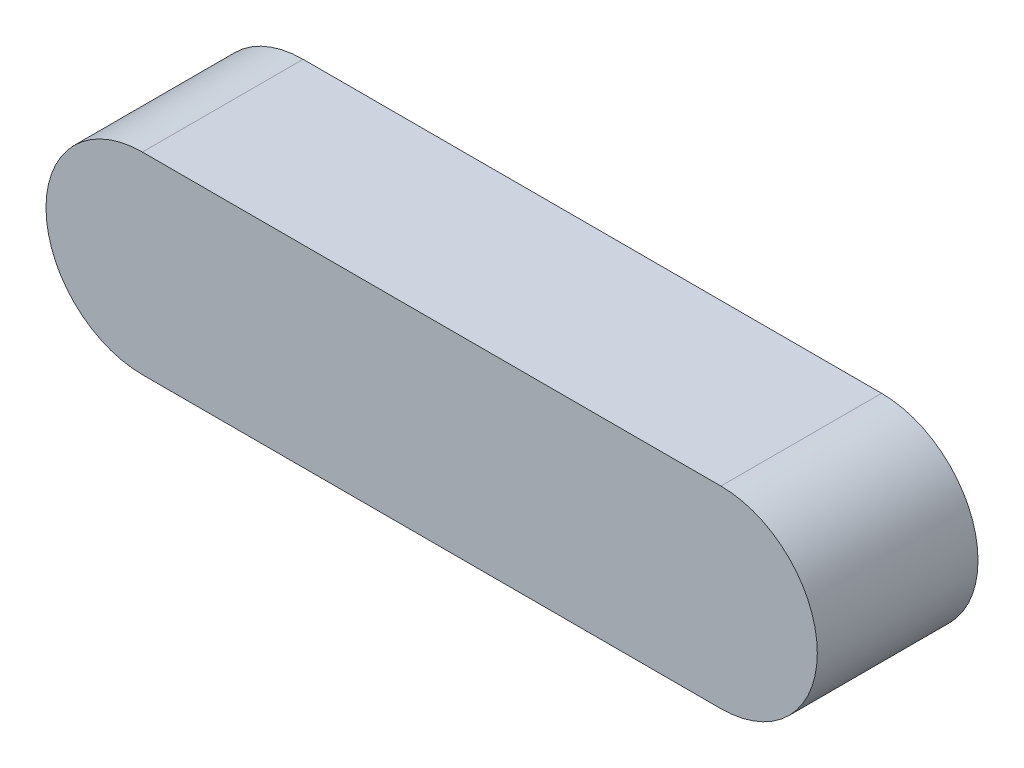
ISO-10303-21;
HEADER;
FILE_DESCRIPTION(('STEP AP214'),'2;1');
FILE_NAME('part.step','',(''),(''),'','','');
FILE_SCHEMA(('AUTOMOTIVE_DESIGN { 1 0 10303 214 1 1 1 1 }'));
ENDSEC;
DATA;
#1=APPLICATION_CONTEXT('core data for automotive mechanical design processes');
#2=APPLICATION_PROTOCOL_DEFINITION('international standard','automotive_design',2000,#1);
#3=PRODUCT_CONTEXT('',#1,'mechanical');
#4=PRODUCT('Part','Part','',(#3));
#5=PRODUCT_RELATED_PRODUCT_CATEGORY('part','',(#4));
#6=PRODUCT_DEFINITION_FORMATION('','',#4);
#7=PRODUCT_DEFINITION_CONTEXT('part definition',#1,'design');
#8=PRODUCT_DEFINITION('design','',#6,#7);
#9=PRODUCT_DEFINITION_SHAPE('','',#8);
#10=(LENGTH_UNIT() NAMED_UNIT(*) SI_UNIT(.MILLI.,.METRE.));
#11=(NAMED_UNIT(*) PLANE_ANGLE_UNIT() SI_UNIT($,.RADIAN.));
#12=(NAMED_UNIT(*) SI_UNIT($,.STERADIAN.) SOLID_ANGLE_UNIT());
#13=UNCERTAINTY_MEASURE_WITH_UNIT(LENGTH_MEASURE(1.E-05),#10,'distance_accuracy_value','');
#14=(GEOMETRIC_REPRESENTATION_CONTEXT(3) GLOBAL_UNCERTAINTY_ASSIGNED_CONTEXT((#13)) GLOBAL_UNIT_ASSIGNED_CONTEXT((#10,
#11,#12)) REPRESENTATION_CONTEXT('',''));
#15=CARTESIAN_POINT('',(0.,0.,0.));
#16=DIRECTION('',(0.,0.,1.));
#17=DIRECTION('',(1.,0.,0.));
#18=AXIS2_PLACEMENT_3D('',#15,#16,#17);
#19=CARTESIAN_POINT('',(0.,0.,63.4999999999999));
#20=DIRECTION('',(0.,0.,-1.));
#21=DIRECTION('',(-1.,0.,0.));
#22=AXIS2_PLACEMENT_3D('',#19,#20,#21);
#23=CYLINDRICAL_SURFACE('',#22,38.1);
#24=CARTESIAN_POINT('',(0.,0.,0.));
#25=DIRECTION('',(0.,0.,1.));
#26=DIRECTION('',(1.,0.,0.));
#27=AXIS2_PLACEMENT_3D('',#24,#25,#26);
#28=CIRCLE('',#27,38.1);
#29=CARTESIAN_POINT('',(0.,38.1,0.));
#30=VERTEX_POINT('',#29);
#31=CARTESIAN_POINT('',(0.,-38.1,0.));
#32=VERTEX_POINT('',#31);
#33=EDGE_CURVE('E111',#30,#32,#28,.T.);
#34=ORIENTED_EDGE('',*,*,#33,.T.);
#35=DIRECTION('',(0.,0.,-1.));
#36=VECTOR('',#35,1.);
#37=CARTESIAN_POINT('',(0.,-38.1,63.4999999999999));
#38=LINE('',#37,#36);
#39=CARTESIAN_POINT('',(0.,-38.1,63.4999999999999));
#40=VERTEX_POINT('',#39);
#41=EDGE_CURVE('E11',#40,#32,#38,.T.);
#42=ORIENTED_EDGE('',*,*,#41,.F.);
#43=CARTESIAN_POINT('',(0.,0.,63.4999999999999));
#44=DIRECTION('',(0.,0.,1.));
#45=DIRECTION('',(1.,0.,0.));
#46=AXIS2_PLACEMENT_3D('',#43,#44,#45);
#47=CIRCLE('',#46,38.1);
#48=CARTESIAN_POINT('',(0.,38.1,63.4999999999999));
#49=VERTEX_POINT('',#48);
#50=EDGE_CURVE('E93',#49,#40,#47,.T.);
#51=ORIENTED_EDGE('',*,*,#50,.F.);
#52=DIRECTION('',(0.,0.,-1.));
#53=VECTOR('',#52,1.);
#54=CARTESIAN_POINT('',(0.,38.1,63.4999999999999));
#55=LINE('',#54,#53);
#56=EDGE_CURVE('E60',#49,#30,#55,.T.);
#57=ORIENTED_EDGE('',*,*,#56,.T.);
#58=EDGE_LOOP('',(#34,#42,#51,#57));
#59=FACE_BOUND('',#58,.T.);
#60=ADVANCED_FACE('F43',(#59),#23,.T.);
#61=CARTESIAN_POINT('',(0.,-38.1,63.4999999999999));
#62=DIRECTION('',(0.,1.,0.));
#63=DIRECTION('',(-1.,0.,0.));
#64=AXIS2_PLACEMENT_3D('',#61,#62,#63);
#65=PLANE('',#64);
#66=DIRECTION('',(1.,0.,0.));
#67=VECTOR('',#66,1.);
#68=CARTESIAN_POINT('',(0.,-38.1,0.));
#69=LINE('',#68,#67);
#70=CARTESIAN_POINT('',(228.6,-38.1,0.));
#71=VERTEX_POINT('',#70);
#72=EDGE_CURVE('E99',#32,#71,#69,.T.);
#73=ORIENTED_EDGE('',*,*,#72,.T.);
#74=DIRECTION('',(0.,0.,-1.));
#75=VECTOR('',#74,1.);
#76=CARTESIAN_POINT('',(228.6,-38.1,63.4999999999999));
#77=LINE('',#76,#75);
#78=CARTESIAN_POINT('',(228.6,-38.1,63.4999999999999));
#79=VERTEX_POINT('',#78);
#80=EDGE_CURVE('E52',#79,#71,#77,.T.);
#81=ORIENTED_EDGE('',*,*,#80,.F.);
#82=DIRECTION('',(1.,0.,0.));
#83=VECTOR('',#82,1.);
#84=CARTESIAN_POINT('',(0.,-38.1,63.4999999999999));
#85=LINE('',#84,#83);
#86=EDGE_CURVE('E86',#40,#79,#85,.T.);
#87=ORIENTED_EDGE('',*,*,#86,.F.);
#88=ORIENTED_EDGE('',*,*,#41,.T.);
#89=EDGE_LOOP('',(#73,#81,#87,#88));
#90=FACE_BOUND('',#89,.T.);
#91=ADVANCED_FACE('F98',(#90),#65,.F.);
#92=CARTESIAN_POINT('',(228.6,0.,63.4999999999999));
#93=DIRECTION('',(0.,0.,-1.));
#94=DIRECTION('',(-1.,0.,0.));
#95=AXIS2_PLACEMENT_3D('',#92,#93,#94);
#96=CYLINDRICAL_SURFACE('',#95,38.1);
#97=CARTESIAN_POINT('',(228.6,0.,0.));
#98=DIRECTION('',(0.,0.,1.));
#99=DIRECTION('',(1.,0.,0.));
#100=AXIS2_PLACEMENT_3D('',#97,#98,#99);
#101=CIRCLE('',#100,38.1);
#102=CARTESIAN_POINT('',(228.6,38.1,0.));
#103=VERTEX_POINT('',#102);
#104=EDGE_CURVE('E116',#71,#103,#101,.T.);
#105=ORIENTED_EDGE('',*,*,#104,.T.);
#106=DIRECTION('',(0.,0.,-1.));
#107=VECTOR('',#106,1.);
#108=CARTESIAN_POINT('',(228.6,38.1,63.4999999999999));
#109=LINE('',#108,#107);
#110=CARTESIAN_POINT('',(228.6,38.1,63.4999999999999));
#111=VERTEX_POINT('',#110);
#112=EDGE_CURVE('E75',#111,#103,#109,.T.);
#113=ORIENTED_EDGE('',*,*,#112,.F.);
#114=CARTESIAN_POINT('',(228.6,0.,63.4999999999999));
#115=DIRECTION('',(0.,0.,1.));
#116=DIRECTION('',(1.,0.,0.));
#117=AXIS2_PLACEMENT_3D('',#114,#115,#116);
#118=CIRCLE('',#117,38.1);
#119=EDGE_CURVE('E92',#79,#111,#118,.T.);
#120=ORIENTED_EDGE('',*,*,#119,.F.);
#121=ORIENTED_EDGE('',*,*,#80,.T.);
#122=EDGE_LOOP('',(#105,#113,#120,#121));
#123=FACE_BOUND('',#122,.T.);
#124=ADVANCED_FACE('F103',(#123),#96,.T.);
#125=CARTESIAN_POINT('',(0.,38.1,63.4999999999999));
#126=DIRECTION('',(0.,1.,0.));
#127=DIRECTION('',(-1.,0.,0.));
#128=AXIS2_PLACEMENT_3D('',#125,#126,#127);
#129=PLANE('',#128);
#130=DIRECTION('',(1.,0.,0.));
#131=VECTOR('',#130,1.);
#132=CARTESIAN_POINT('',(0.,38.1,0.));
#133=LINE('',#132,#131);
#134=EDGE_CURVE('E119',#30,#103,#133,.T.);
#135=ORIENTED_EDGE('',*,*,#134,.F.);
#136=ORIENTED_EDGE('',*,*,#56,.F.);
#137=DIRECTION('',(1.,0.,0.));
#138=VECTOR('',#137,1.);
#139=CARTESIAN_POINT('',(0.,38.1,63.4999999999999));
#140=LINE('',#139,#138);
#141=EDGE_CURVE('E105',#49,#111,#140,.T.);
#142=ORIENTED_EDGE('',*,*,#141,.T.);
#143=ORIENTED_EDGE('',*,*,#112,.T.);
#144=EDGE_LOOP('',(#135,#136,#142,#143));
#145=FACE_BOUND('',#144,.T.);
#146=ADVANCED_FACE('F129',(#145),#129,.T.);
#147=CARTESIAN_POINT('',(0.,0.,63.4999999999999));
#148=DIRECTION('',(0.,0.,1.));
#149=DIRECTION('',(1.,0.,0.));
#150=AXIS2_PLACEMENT_3D('',#147,#148,#149);
#151=PLANE('',#150);
#152=ORIENTED_EDGE('',*,*,#50,.T.);
#153=ORIENTED_EDGE('',*,*,#86,.T.);
#154=ORIENTED_EDGE('',*,*,#119,.T.);
#155=ORIENTED_EDGE('',*,*,#141,.F.);
#156=EDGE_LOOP('',(#152,#153,#154,#155));
#157=FACE_BOUND('',#156,.T.);
#158=ADVANCED_FACE('F89',(#157),#151,.T.);
#159=CARTESIAN_POINT('',(0.,0.,0.));
#160=DIRECTION('',(0.,0.,1.));
#161=DIRECTION('',(1.,0.,0.));
#162=AXIS2_PLACEMENT_3D('',#159,#160,#161);
#163=PLANE('',#162);
#164=ORIENTED_EDGE('',*,*,#33,.F.);
#165=ORIENTED_EDGE('',*,*,#134,.T.);
#166=ORIENTED_EDGE('',*,*,#104,.F.);
#167=ORIENTED_EDGE('',*,*,#72,.F.);
#168=EDGE_LOOP('',(#164,#165,#166,#167));
#169=FACE_BOUND('',#168,.T.);
#170=ADVANCED_FACE('F128',(#169),#163,.F.);
#171=CLOSED_SHELL('',(#60,#91,#124,#146,#158,#170));
#172=MANIFOLD_SOLID_BREP('B2',#171);
#173=ADVANCED_BREP_SHAPE_REPRESENTATION('',(#18,#172),#14);
#174=SHAPE_DEFINITION_REPRESENTATION(#9,#173);
ENDSEC;
END-ISO-10303-21;
